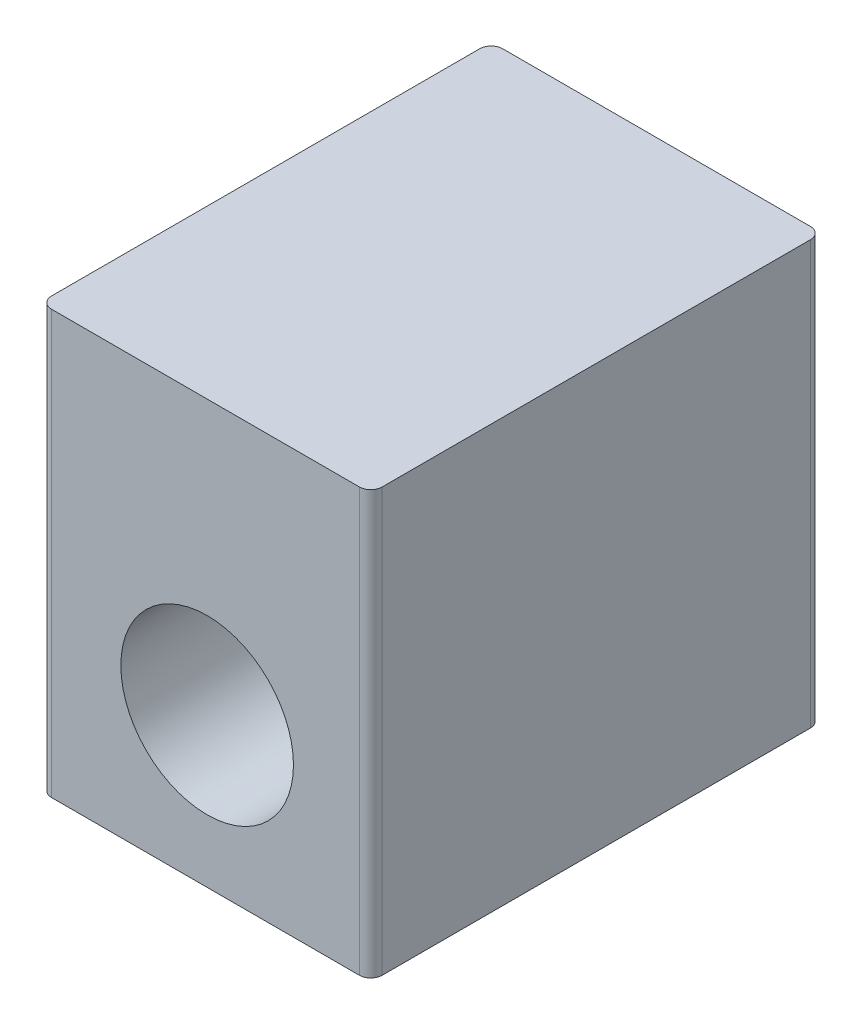
ISO-10303-21;
HEADER;
FILE_DESCRIPTION(('STEP AP214'),'2;1');
FILE_NAME('part.step','',(''),(''),'','','');
FILE_SCHEMA(('AUTOMOTIVE_DESIGN { 1 0 10303 214 1 1 1 1 }'));
ENDSEC;
DATA;
#1=APPLICATION_CONTEXT('core data for automotive mechanical design processes');
#2=APPLICATION_PROTOCOL_DEFINITION('international standard','automotive_design',2000,#1);
#3=PRODUCT_CONTEXT('',#1,'mechanical');
#4=PRODUCT('Part','Part','',(#3));
#5=PRODUCT_RELATED_PRODUCT_CATEGORY('part','',(#4));
#6=PRODUCT_DEFINITION_FORMATION('','',#4);
#7=PRODUCT_DEFINITION_CONTEXT('part definition',#1,'design');
#8=PRODUCT_DEFINITION('design','',#6,#7);
#9=PRODUCT_DEFINITION_SHAPE('','',#8);
#10=(LENGTH_UNIT() NAMED_UNIT(*) SI_UNIT(.MILLI.,.METRE.));
#11=(NAMED_UNIT(*) PLANE_ANGLE_UNIT() SI_UNIT($,.RADIAN.));
#12=(NAMED_UNIT(*) SI_UNIT($,.STERADIAN.) SOLID_ANGLE_UNIT());
#13=UNCERTAINTY_MEASURE_WITH_UNIT(LENGTH_MEASURE(1.E-05),#10,'distance_accuracy_value','');
#14=(GEOMETRIC_REPRESENTATION_CONTEXT(3) GLOBAL_UNCERTAINTY_ASSIGNED_CONTEXT((#13)) GLOBAL_UNIT_ASSIGNED_CONTEXT((#10,
#11,#12)) REPRESENTATION_CONTEXT('',''));
#15=CARTESIAN_POINT('',(0.,0.,0.));
#16=DIRECTION('',(0.,0.,1.));
#17=DIRECTION('',(1.,0.,0.));
#18=AXIS2_PLACEMENT_3D('',#15,#16,#17);
#19=CARTESIAN_POINT('',(0.,28.194,0.));
#20=DIRECTION('',(1.,0.,0.));
#21=DIRECTION('',(0.,0.,-1.));
#22=AXIS2_PLACEMENT_3D('',#19,#20,#21);
#23=PLANE('',#22);
#24=DIRECTION('',(0.,0.,1.));
#25=VECTOR('',#24,1.);
#26=CARTESIAN_POINT('',(0.,28.194,0.));
#27=LINE('',#26,#25);
#28=CARTESIAN_POINT('',(0.,28.194,-29.3116));
#29=VERTEX_POINT('',#28);
#30=CARTESIAN_POINT('',(0.,28.194,-0.762));
#31=VERTEX_POINT('',#30);
#32=EDGE_CURVE('E117',#29,#31,#27,.T.);
#33=ORIENTED_EDGE('',*,*,#32,.F.);
#34=DIRECTION('',(0.,-1.,0.));
#35=VECTOR('',#34,1.);
#36=CARTESIAN_POINT('',(0.,28.194,-29.3116));
#37=LINE('',#36,#35);
#38=CARTESIAN_POINT('',(0.,0.,-29.3116));
#39=VERTEX_POINT('',#38);
#40=EDGE_CURVE('E102',#29,#39,#37,.T.);
#41=ORIENTED_EDGE('',*,*,#40,.T.);
#42=DIRECTION('',(0.,0.,1.));
#43=VECTOR('',#42,1.);
#44=CARTESIAN_POINT('',(0.,0.,0.));
#45=LINE('',#44,#43);
#46=CARTESIAN_POINT('',(0.,0.,-0.762));
#47=VERTEX_POINT('',#46);
#48=EDGE_CURVE('E114',#39,#47,#45,.T.);
#49=ORIENTED_EDGE('',*,*,#48,.T.);
#50=DIRECTION('',(0.,-1.,0.));
#51=VECTOR('',#50,1.);
#52=CARTESIAN_POINT('',(0.,28.194,-0.762));
#53=LINE('',#52,#51);
#54=EDGE_CURVE('E119',#47,#31,#53,.F.);
#55=ORIENTED_EDGE('',*,*,#54,.T.);
#56=EDGE_LOOP('',(#33,#41,#49,#55));
#57=FACE_BOUND('',#56,.T.);
#58=ADVANCED_FACE('F32',(#57),#23,.F.);
#59=CARTESIAN_POINT('',(0.,28.194,0.));
#60=DIRECTION('',(0.,0.,-1.));
#61=DIRECTION('',(-1.,0.,0.));
#62=AXIS2_PLACEMENT_3D('',#59,#60,#61);
#63=PLANE('',#62);
#64=CARTESIAN_POINT('',(11.1379,9.9441,0.));
#65=DIRECTION('',(0.,0.,1.));
#66=DIRECTION('',(1.,0.,0.));
#67=AXIS2_PLACEMENT_3D('',#64,#65,#66);
#68=CIRCLE('',#67,5.7531);
#69=CARTESIAN_POINT('',(16.891,9.9441,0.));
#70=VERTEX_POINT('',#69);
#71=EDGE_CURVE('E186',#70,#70,#68,.T.);
#72=ORIENTED_EDGE('',*,*,#71,.F.);
#73=EDGE_LOOP('',(#72));
#74=FACE_BOUND('',#73,.T.);
#75=DIRECTION('',(1.,0.,0.));
#76=VECTOR('',#75,1.);
#77=CARTESIAN_POINT('',(0.,0.,0.));
#78=LINE('',#77,#76);
#79=CARTESIAN_POINT('',(0.762,0.,0.));
#80=VERTEX_POINT('',#79);
#81=CARTESIAN_POINT('',(21.2852,0.,0.));
#82=VERTEX_POINT('',#81);
#83=EDGE_CURVE('E123',#80,#82,#78,.T.);
#84=ORIENTED_EDGE('',*,*,#83,.T.);
#85=DIRECTION('',(0.,-1.,0.));
#86=VECTOR('',#85,1.);
#87=CARTESIAN_POINT('',(21.2852,28.194,0.));
#88=LINE('',#87,#86);
#89=CARTESIAN_POINT('',(21.2852,28.194,0.));
#90=VERTEX_POINT('',#89);
#91=EDGE_CURVE('E11',#82,#90,#88,.F.);
#92=ORIENTED_EDGE('',*,*,#91,.T.);
#93=DIRECTION('',(1.,0.,0.));
#94=VECTOR('',#93,1.);
#95=CARTESIAN_POINT('',(0.,28.194,0.));
#96=LINE('',#95,#94);
#97=CARTESIAN_POINT('',(0.762,28.194,0.));
#98=VERTEX_POINT('',#97);
#99=EDGE_CURVE('E163',#98,#90,#96,.T.);
#100=ORIENTED_EDGE('',*,*,#99,.F.);
#101=DIRECTION('',(0.,-1.,0.));
#102=VECTOR('',#101,1.);
#103=CARTESIAN_POINT('',(0.762,28.194,0.));
#104=LINE('',#103,#102);
#105=EDGE_CURVE('E40',#98,#80,#104,.T.);
#106=ORIENTED_EDGE('',*,*,#105,.T.);
#107=EDGE_LOOP('',(#84,#92,#100,#106));
#108=FACE_BOUND('',#107,.T.);
#109=ADVANCED_FACE('F161',(#74,#108),#63,.F.);
#110=CARTESIAN_POINT('',(22.0472,28.194,0.));
#111=DIRECTION('',(-1.,0.,0.));
#112=DIRECTION('',(0.,0.,1.));
#113=AXIS2_PLACEMENT_3D('',#110,#111,#112);
#114=PLANE('',#113);
#115=DIRECTION('',(0.,0.,-1.));
#116=VECTOR('',#115,1.);
#117=CARTESIAN_POINT('',(22.0472,0.,0.));
#118=LINE('',#117,#116);
#119=CARTESIAN_POINT('',(22.0472,0.,-0.762));
#120=VERTEX_POINT('',#119);
#121=CARTESIAN_POINT('',(22.0472,0.,-29.3116));
#122=VERTEX_POINT('',#121);
#123=EDGE_CURVE('E127',#120,#122,#118,.T.);
#124=ORIENTED_EDGE('',*,*,#123,.T.);
#125=DIRECTION('',(0.,-1.,0.));
#126=VECTOR('',#125,1.);
#127=CARTESIAN_POINT('',(22.0472,28.194,-29.3116));
#128=LINE('',#127,#126);
#129=CARTESIAN_POINT('',(22.0472,28.194,-29.3116));
#130=VERTEX_POINT('',#129);
#131=EDGE_CURVE('E47',#122,#130,#128,.F.);
#132=ORIENTED_EDGE('',*,*,#131,.T.);
#133=DIRECTION('',(0.,0.,-1.));
#134=VECTOR('',#133,1.);
#135=CARTESIAN_POINT('',(22.0472,28.194,0.));
#136=LINE('',#135,#134);
#137=CARTESIAN_POINT('',(22.0472,28.194,-0.762));
#138=VERTEX_POINT('',#137);
#139=EDGE_CURVE('E171',#138,#130,#136,.T.);
#140=ORIENTED_EDGE('',*,*,#139,.F.);
#141=DIRECTION('',(0.,-1.,0.));
#142=VECTOR('',#141,1.);
#143=CARTESIAN_POINT('',(22.0472,28.194,-0.762));
#144=LINE('',#143,#142);
#145=EDGE_CURVE('E154',#138,#120,#144,.T.);
#146=ORIENTED_EDGE('',*,*,#145,.T.);
#147=EDGE_LOOP('',(#124,#132,#140,#146));
#148=FACE_BOUND('',#147,.T.);
#149=ADVANCED_FACE('F170',(#148),#114,.F.);
#150=CARTESIAN_POINT('',(0.,28.194,-30.0736));
#151=DIRECTION('',(0.,0.,1.));
#152=DIRECTION('',(1.,0.,0.));
#153=AXIS2_PLACEMENT_3D('',#150,#151,#152);
#154=PLANE('',#153);
#155=CARTESIAN_POINT('',(10.9093,9.7917,-30.0736));
#156=DIRECTION('',(0.,0.,-1.));
#157=DIRECTION('',(-1.,0.,0.));
#158=AXIS2_PLACEMENT_3D('',#155,#156,#157);
#159=CIRCLE('',#158,5.7531);
#160=CARTESIAN_POINT('',(5.1562,9.7917,-30.0736));
#161=VERTEX_POINT('',#160);
#162=EDGE_CURVE('E192',#161,#161,#159,.T.);
#163=ORIENTED_EDGE('',*,*,#162,.F.);
#164=EDGE_LOOP('',(#163));
#165=FACE_BOUND('',#164,.T.);
#166=DIRECTION('',(-1.,0.,0.));
#167=VECTOR('',#166,1.);
#168=CARTESIAN_POINT('',(0.,0.,-30.0736));
#169=LINE('',#168,#167);
#170=CARTESIAN_POINT('',(21.2852,0.,-30.0736));
#171=VERTEX_POINT('',#170);
#172=CARTESIAN_POINT('',(0.762,0.,-30.0736));
#173=VERTEX_POINT('',#172);
#174=EDGE_CURVE('E137',#171,#173,#169,.T.);
#175=ORIENTED_EDGE('',*,*,#174,.T.);
#176=DIRECTION('',(0.,-1.,0.));
#177=VECTOR('',#176,1.);
#178=CARTESIAN_POINT('',(0.762,28.194,-30.0736));
#179=LINE('',#178,#177);
#180=CARTESIAN_POINT('',(0.762,28.194,-30.0736));
#181=VERTEX_POINT('',#180);
#182=EDGE_CURVE('E103',#173,#181,#179,.F.);
#183=ORIENTED_EDGE('',*,*,#182,.T.);
#184=DIRECTION('',(-1.,0.,0.));
#185=VECTOR('',#184,1.);
#186=CARTESIAN_POINT('',(0.,28.194,-30.0736));
#187=LINE('',#186,#185);
#188=CARTESIAN_POINT('',(21.2852,28.194,-30.0736));
#189=VERTEX_POINT('',#188);
#190=EDGE_CURVE('E133',#189,#181,#187,.T.);
#191=ORIENTED_EDGE('',*,*,#190,.F.);
#192=DIRECTION('',(0.,-1.,0.));
#193=VECTOR('',#192,1.);
#194=CARTESIAN_POINT('',(21.2852,28.194,-30.0736));
#195=LINE('',#194,#193);
#196=EDGE_CURVE('E108',#189,#171,#195,.T.);
#197=ORIENTED_EDGE('',*,*,#196,.T.);
#198=EDGE_LOOP('',(#175,#183,#191,#197));
#199=FACE_BOUND('',#198,.T.);
#200=ADVANCED_FACE('F207',(#165,#199),#154,.F.);
#201=CARTESIAN_POINT('',(0.,28.194,0.));
#202=DIRECTION('',(0.,-1.,0.));
#203=DIRECTION('',(0.,0.,-1.));
#204=AXIS2_PLACEMENT_3D('',#201,#202,#203);
#205=PLANE('',#204);
#206=ORIENTED_EDGE('',*,*,#190,.T.);
#207=CARTESIAN_POINT('',(0.762,28.194,-29.3116));
#208=DIRECTION('',(0.,-1.,0.));
#209=DIRECTION('',(0.,0.,-1.));
#210=AXIS2_PLACEMENT_3D('',#207,#208,#209);
#211=CIRCLE('',#210,0.762);
#212=EDGE_CURVE('E152',#181,#29,#211,.F.);
#213=ORIENTED_EDGE('',*,*,#212,.T.);
#214=ORIENTED_EDGE('',*,*,#32,.T.);
#215=CARTESIAN_POINT('',(0.762,28.194,-0.762));
#216=DIRECTION('',(0.,-1.,0.));
#217=DIRECTION('',(0.,0.,-1.));
#218=AXIS2_PLACEMENT_3D('',#215,#216,#217);
#219=CIRCLE('',#218,0.762);
#220=EDGE_CURVE('E147',#31,#98,#219,.F.);
#221=ORIENTED_EDGE('',*,*,#220,.T.);
#222=ORIENTED_EDGE('',*,*,#99,.T.);
#223=CARTESIAN_POINT('',(21.2852,28.194,-0.762));
#224=DIRECTION('',(0.,-1.,0.));
#225=DIRECTION('',(0.,0.,-1.));
#226=AXIS2_PLACEMENT_3D('',#223,#224,#225);
#227=CIRCLE('',#226,0.762);
#228=EDGE_CURVE('E54',#90,#138,#227,.F.);
#229=ORIENTED_EDGE('',*,*,#228,.T.);
#230=ORIENTED_EDGE('',*,*,#139,.T.);
#231=CARTESIAN_POINT('',(21.2852,28.194,-29.3116));
#232=DIRECTION('',(0.,-1.,0.));
#233=DIRECTION('',(0.,0.,-1.));
#234=AXIS2_PLACEMENT_3D('',#231,#232,#233);
#235=CIRCLE('',#234,0.762);
#236=EDGE_CURVE('E150',#130,#189,#235,.F.);
#237=ORIENTED_EDGE('',*,*,#236,.T.);
#238=EDGE_LOOP('',(#206,#213,#214,#221,#222,#229,#230,#237));
#239=FACE_BOUND('',#238,.T.);
#240=ADVANCED_FACE('F210',(#239),#205,.F.);
#241=CARTESIAN_POINT('',(0.,0.,0.));
#242=DIRECTION('',(0.,-1.,0.));
#243=DIRECTION('',(0.,0.,-1.));
#244=AXIS2_PLACEMENT_3D('',#241,#242,#243);
#245=PLANE('',#244);
#246=CARTESIAN_POINT('',(18.7071,0.,-5.2705));
#247=DIRECTION('',(0.,-1.,0.));
#248=DIRECTION('',(0.,0.,-1.));
#249=AXIS2_PLACEMENT_3D('',#246,#247,#248);
#250=CIRCLE('',#249,1.5875);
#251=CARTESIAN_POINT('',(18.7071,0.,-6.858));
#252=VERTEX_POINT('',#251);
#253=EDGE_CURVE('E180',#252,#252,#250,.T.);
#254=ORIENTED_EDGE('',*,*,#253,.F.);
#255=EDGE_LOOP('',(#254));
#256=FACE_BOUND('',#255,.T.);
#257=CARTESIAN_POINT('',(3.2131,0.,-5.2705));
#258=DIRECTION('',(0.,-1.,0.));
#259=DIRECTION('',(0.,0.,-1.));
#260=AXIS2_PLACEMENT_3D('',#257,#258,#259);
#261=CIRCLE('',#260,1.5875);
#262=CARTESIAN_POINT('',(3.2131,0.,-6.858));
#263=VERTEX_POINT('',#262);
#264=EDGE_CURVE('E130',#263,#263,#261,.T.);
#265=ORIENTED_EDGE('',*,*,#264,.F.);
#266=EDGE_LOOP('',(#265));
#267=FACE_BOUND('',#266,.T.);
#268=ORIENTED_EDGE('',*,*,#48,.F.);
#269=CARTESIAN_POINT('',(0.762,0.,-29.3116));
#270=DIRECTION('',(0.,-1.,0.));
#271=DIRECTION('',(0.,0.,-1.));
#272=AXIS2_PLACEMENT_3D('',#269,#270,#271);
#273=CIRCLE('',#272,0.762);
#274=EDGE_CURVE('E98',#39,#173,#273,.T.);
#275=ORIENTED_EDGE('',*,*,#274,.T.);
#276=ORIENTED_EDGE('',*,*,#174,.F.);
#277=CARTESIAN_POINT('',(21.2852,0.,-29.3116));
#278=DIRECTION('',(0.,-1.,0.));
#279=DIRECTION('',(0.,0.,-1.));
#280=AXIS2_PLACEMENT_3D('',#277,#278,#279);
#281=CIRCLE('',#280,0.762);
#282=EDGE_CURVE('E109',#171,#122,#281,.T.);
#283=ORIENTED_EDGE('',*,*,#282,.T.);
#284=ORIENTED_EDGE('',*,*,#123,.F.);
#285=CARTESIAN_POINT('',(21.2852,0.,-0.762));
#286=DIRECTION('',(0.,-1.,0.));
#287=DIRECTION('',(0.,0.,-1.));
#288=AXIS2_PLACEMENT_3D('',#285,#286,#287);
#289=CIRCLE('',#288,0.762);
#290=EDGE_CURVE('E141',#120,#82,#289,.T.);
#291=ORIENTED_EDGE('',*,*,#290,.T.);
#292=ORIENTED_EDGE('',*,*,#83,.F.);
#293=CARTESIAN_POINT('',(0.762,0.,-0.762));
#294=DIRECTION('',(0.,-1.,0.));
#295=DIRECTION('',(0.,0.,-1.));
#296=AXIS2_PLACEMENT_3D('',#293,#294,#295);
#297=CIRCLE('',#296,0.762);
#298=EDGE_CURVE('E118',#80,#47,#297,.T.);
#299=ORIENTED_EDGE('',*,*,#298,.T.);
#300=EDGE_LOOP('',(#268,#275,#276,#283,#284,#291,#292,#299));
#301=FACE_BOUND('',#300,.T.);
#302=ADVANCED_FACE('F121',(#256,#267,#301),#245,.T.);
#303=CARTESIAN_POINT('',(3.2131,4.826,-5.2705));
#304=DIRECTION('',(0.,-1.,0.));
#305=DIRECTION('',(0.,0.,-1.));
#306=AXIS2_PLACEMENT_3D('',#303,#304,#305);
#307=CYLINDRICAL_SURFACE('',#306,1.5875);
#308=CARTESIAN_POINT('',(3.2131,4.826,-5.2705));
#309=DIRECTION('',(0.,-1.,0.));
#310=DIRECTION('',(0.,0.,-1.));
#311=AXIS2_PLACEMENT_3D('',#308,#309,#310);
#312=CIRCLE('',#311,1.5875);
#313=CARTESIAN_POINT('',(3.2131,4.826,-6.858));
#314=VERTEX_POINT('',#313);
#315=EDGE_CURVE('E124',#314,#314,#312,.T.);
#316=ORIENTED_EDGE('',*,*,#315,.F.);
#317=EDGE_LOOP('',(#316));
#318=FACE_BOUND('',#317,.T.);
#319=ORIENTED_EDGE('',*,*,#264,.T.);
#320=EDGE_LOOP('',(#319));
#321=FACE_BOUND('',#320,.T.);
#322=ADVANCED_FACE('F309',(#318,#321),#307,.F.);
#323=CARTESIAN_POINT('',(3.2131,4.826,-5.2705));
#324=DIRECTION('',(0.,-1.,0.));
#325=DIRECTION('',(0.,0.,-1.));
#326=AXIS2_PLACEMENT_3D('',#323,#324,#325);
#327=PLANE('',#326);
#328=ORIENTED_EDGE('',*,*,#315,.T.);
#329=EDGE_LOOP('',(#328));
#330=FACE_BOUND('',#329,.T.);
#331=ADVANCED_FACE('F300',(#330),#327,.T.);
#332=CARTESIAN_POINT('',(18.7071,4.826,-5.2705));
#333=DIRECTION('',(0.,-1.,0.));
#334=DIRECTION('',(0.,0.,-1.));
#335=AXIS2_PLACEMENT_3D('',#332,#333,#334);
#336=CYLINDRICAL_SURFACE('',#335,1.5875);
#337=CARTESIAN_POINT('',(18.7071,4.826,-5.2705));
#338=DIRECTION('',(0.,-1.,0.));
#339=DIRECTION('',(0.,0.,-1.));
#340=AXIS2_PLACEMENT_3D('',#337,#338,#339);
#341=CIRCLE('',#340,1.5875);
#342=CARTESIAN_POINT('',(18.7071,4.826,-6.858));
#343=VERTEX_POINT('',#342);
#344=EDGE_CURVE('E178',#343,#343,#341,.T.);
#345=ORIENTED_EDGE('',*,*,#344,.F.);
#346=EDGE_LOOP('',(#345));
#347=FACE_BOUND('',#346,.T.);
#348=ORIENTED_EDGE('',*,*,#253,.T.);
#349=EDGE_LOOP('',(#348));
#350=FACE_BOUND('',#349,.T.);
#351=ADVANCED_FACE('F291',(#347,#350),#336,.F.);
#352=CARTESIAN_POINT('',(18.7071,4.826,-5.2705));
#353=DIRECTION('',(0.,-1.,0.));
#354=DIRECTION('',(0.,0.,-1.));
#355=AXIS2_PLACEMENT_3D('',#352,#353,#354);
#356=PLANE('',#355);
#357=ORIENTED_EDGE('',*,*,#344,.T.);
#358=EDGE_LOOP('',(#357));
#359=FACE_BOUND('',#358,.T.);
#360=ADVANCED_FACE('F282',(#359),#356,.T.);
#361=CARTESIAN_POINT('',(11.1379,9.9441,-13.462));
#362=DIRECTION('',(0.,0.,1.));
#363=DIRECTION('',(1.,0.,0.));
#364=AXIS2_PLACEMENT_3D('',#361,#362,#363);
#365=CYLINDRICAL_SURFACE('',#364,5.7531);
#366=CARTESIAN_POINT('',(11.1379,9.9441,-13.462));
#367=DIRECTION('',(0.,0.,1.));
#368=DIRECTION('',(1.,0.,0.));
#369=AXIS2_PLACEMENT_3D('',#366,#367,#368);
#370=CIRCLE('',#369,5.7531);
#371=CARTESIAN_POINT('',(16.891,9.9441,-13.462));
#372=VERTEX_POINT('',#371);
#373=EDGE_CURVE('E183',#372,#372,#370,.T.);
#374=ORIENTED_EDGE('',*,*,#373,.F.);
#375=EDGE_LOOP('',(#374));
#376=FACE_BOUND('',#375,.T.);
#377=ORIENTED_EDGE('',*,*,#71,.T.);
#378=EDGE_LOOP('',(#377));
#379=FACE_BOUND('',#378,.T.);
#380=ADVANCED_FACE('F273',(#376,#379),#365,.F.);
#381=CARTESIAN_POINT('',(11.1379,9.9441,-13.462));
#382=DIRECTION('',(0.,0.,1.));
#383=DIRECTION('',(1.,0.,0.));
#384=AXIS2_PLACEMENT_3D('',#381,#382,#383);
#385=PLANE('',#384);
#386=ORIENTED_EDGE('',*,*,#373,.T.);
#387=EDGE_LOOP('',(#386));
#388=FACE_BOUND('',#387,.T.);
#389=ADVANCED_FACE('F203',(#388),#385,.T.);
#390=CARTESIAN_POINT('',(10.9093,9.7917,-16.6116));
#391=DIRECTION('',(0.,0.,-1.));
#392=DIRECTION('',(-1.,0.,0.));
#393=AXIS2_PLACEMENT_3D('',#390,#391,#392);
#394=CYLINDRICAL_SURFACE('',#393,5.7531);
#395=CARTESIAN_POINT('',(10.9093,9.7917,-16.6116));
#396=DIRECTION('',(0.,0.,-1.));
#397=DIRECTION('',(-1.,0.,0.));
#398=AXIS2_PLACEMENT_3D('',#395,#396,#397);
#399=CIRCLE('',#398,5.7531);
#400=CARTESIAN_POINT('',(5.1562,9.7917,-16.6116));
#401=VERTEX_POINT('',#400);
#402=EDGE_CURVE('E189',#401,#401,#399,.T.);
#403=ORIENTED_EDGE('',*,*,#402,.F.);
#404=EDGE_LOOP('',(#403));
#405=FACE_BOUND('',#404,.T.);
#406=ORIENTED_EDGE('',*,*,#162,.T.);
#407=EDGE_LOOP('',(#406));
#408=FACE_BOUND('',#407,.T.);
#409=ADVANCED_FACE('F200',(#405,#408),#394,.F.);
#410=CARTESIAN_POINT('',(10.9093,9.7917,-16.6116));
#411=DIRECTION('',(0.,0.,-1.));
#412=DIRECTION('',(-1.,0.,0.));
#413=AXIS2_PLACEMENT_3D('',#410,#411,#412);
#414=PLANE('',#413);
#415=ORIENTED_EDGE('',*,*,#402,.T.);
#416=EDGE_LOOP('',(#415));
#417=FACE_BOUND('',#416,.T.);
#418=ADVANCED_FACE('F198',(#417),#414,.T.);
#419=CARTESIAN_POINT('',(0.762,28.194,-29.3116));
#420=DIRECTION('',(0.,-1.,0.));
#421=DIRECTION('',(0.,0.,-1.));
#422=AXIS2_PLACEMENT_3D('',#419,#420,#421);
#423=CYLINDRICAL_SURFACE('',#422,0.762);
#424=ORIENTED_EDGE('',*,*,#212,.F.);
#425=ORIENTED_EDGE('',*,*,#182,.F.);
#426=ORIENTED_EDGE('',*,*,#274,.F.);
#427=ORIENTED_EDGE('',*,*,#40,.F.);
#428=EDGE_LOOP('',(#424,#425,#426,#427));
#429=FACE_BOUND('',#428,.T.);
#430=ADVANCED_FACE('F101',(#429),#423,.T.);
#431=CARTESIAN_POINT('',(21.2852,28.194,-29.3116));
#432=DIRECTION('',(0.,-1.,0.));
#433=DIRECTION('',(0.,0.,-1.));
#434=AXIS2_PLACEMENT_3D('',#431,#432,#433);
#435=CYLINDRICAL_SURFACE('',#434,0.762);
#436=ORIENTED_EDGE('',*,*,#236,.F.);
#437=ORIENTED_EDGE('',*,*,#131,.F.);
#438=ORIENTED_EDGE('',*,*,#282,.F.);
#439=ORIENTED_EDGE('',*,*,#196,.F.);
#440=EDGE_LOOP('',(#436,#437,#438,#439));
#441=FACE_BOUND('',#440,.T.);
#442=ADVANCED_FACE('F215',(#441),#435,.T.);
#443=CARTESIAN_POINT('',(21.2852,28.194,-0.762));
#444=DIRECTION('',(0.,-1.,0.));
#445=DIRECTION('',(0.,0.,-1.));
#446=AXIS2_PLACEMENT_3D('',#443,#444,#445);
#447=CYLINDRICAL_SURFACE('',#446,0.762);
#448=ORIENTED_EDGE('',*,*,#228,.F.);
#449=ORIENTED_EDGE('',*,*,#91,.F.);
#450=ORIENTED_EDGE('',*,*,#290,.F.);
#451=ORIENTED_EDGE('',*,*,#145,.F.);
#452=EDGE_LOOP('',(#448,#449,#450,#451));
#453=FACE_BOUND('',#452,.T.);
#454=ADVANCED_FACE('F169',(#453),#447,.T.);
#455=CARTESIAN_POINT('',(0.762,28.194,-0.762));
#456=DIRECTION('',(0.,-1.,0.));
#457=DIRECTION('',(0.,0.,-1.));
#458=AXIS2_PLACEMENT_3D('',#455,#456,#457);
#459=CYLINDRICAL_SURFACE('',#458,0.762);
#460=ORIENTED_EDGE('',*,*,#220,.F.);
#461=ORIENTED_EDGE('',*,*,#54,.F.);
#462=ORIENTED_EDGE('',*,*,#298,.F.);
#463=ORIENTED_EDGE('',*,*,#105,.F.);
#464=EDGE_LOOP('',(#460,#461,#462,#463));
#465=FACE_BOUND('',#464,.T.);
#466=ADVANCED_FACE('F34',(#465),#459,.T.);
#467=CLOSED_SHELL('',(#58,#109,#149,#200,#240,#302,#322,#331,#351,#360,#380,#389,#409,#418,#430,
#442,#454,#466));
#468=MANIFOLD_SOLID_BREP('B2',#467);
#469=ADVANCED_BREP_SHAPE_REPRESENTATION('',(#18,#468),#14);
#470=SHAPE_DEFINITION_REPRESENTATION(#9,#469);
ENDSEC;
END-ISO-10303-21;
